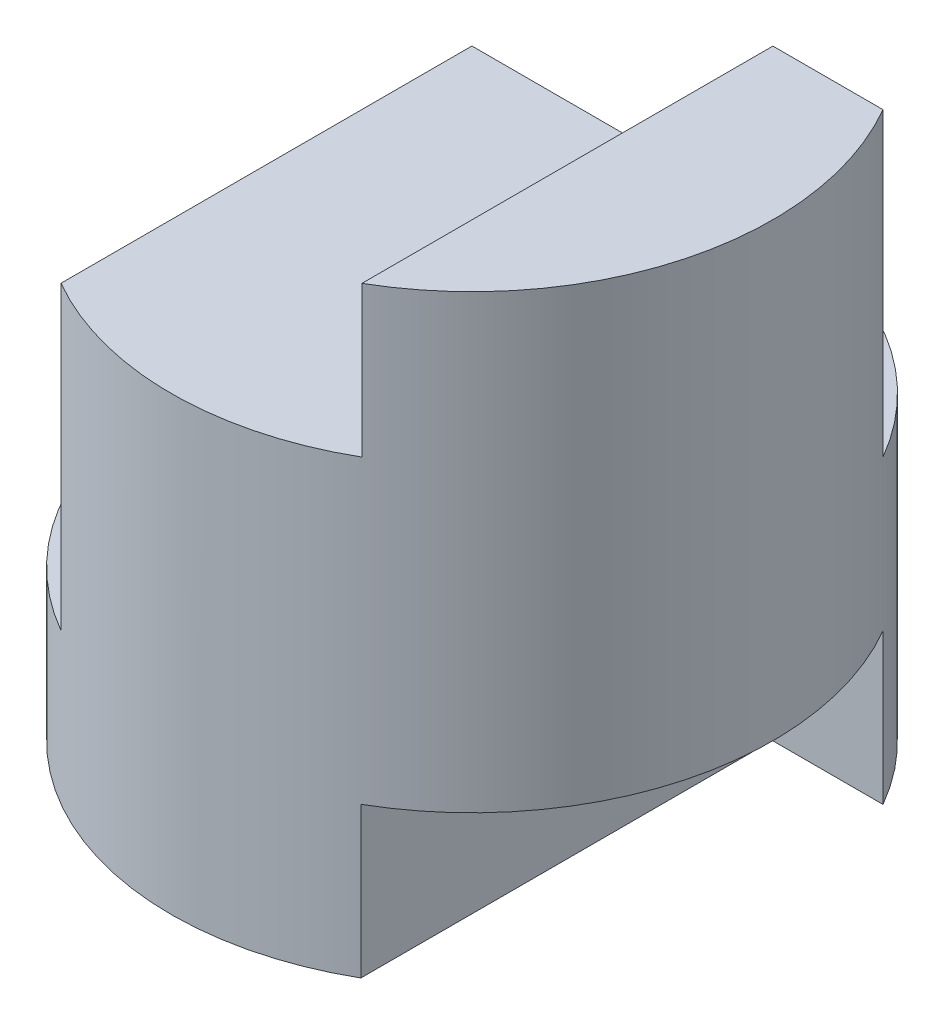
ISO-10303-21;
HEADER;
FILE_DESCRIPTION(('STEP AP214'),'2;1');
FILE_NAME('part.step','',(''),(''),'','','');
FILE_SCHEMA(('AUTOMOTIVE_DESIGN { 1 0 10303 214 1 1 1 1 }'));
ENDSEC;
DATA;
#1=APPLICATION_CONTEXT('core data for automotive mechanical design processes');
#2=APPLICATION_PROTOCOL_DEFINITION('international standard','automotive_design',2000,#1);
#3=PRODUCT_CONTEXT('',#1,'mechanical');
#4=PRODUCT('Part','Part','',(#3));
#5=PRODUCT_RELATED_PRODUCT_CATEGORY('part','',(#4));
#6=PRODUCT_DEFINITION_FORMATION('','',#4);
#7=PRODUCT_DEFINITION_CONTEXT('part definition',#1,'design');
#8=PRODUCT_DEFINITION('design','',#6,#7);
#9=PRODUCT_DEFINITION_SHAPE('','',#8);
#10=(LENGTH_UNIT() NAMED_UNIT(*) SI_UNIT(.MILLI.,.METRE.));
#11=(NAMED_UNIT(*) PLANE_ANGLE_UNIT() SI_UNIT($,.RADIAN.));
#12=(NAMED_UNIT(*) SI_UNIT($,.STERADIAN.) SOLID_ANGLE_UNIT());
#13=UNCERTAINTY_MEASURE_WITH_UNIT(LENGTH_MEASURE(1.E-05),#10,'distance_accuracy_value','');
#14=(GEOMETRIC_REPRESENTATION_CONTEXT(3) GLOBAL_UNCERTAINTY_ASSIGNED_CONTEXT((#13)) GLOBAL_UNIT_ASSIGNED_CONTEXT((#10,
#11,#12)) REPRESENTATION_CONTEXT('',''));
#15=CARTESIAN_POINT('',(0.,0.,0.));
#16=DIRECTION('',(0.,0.,1.));
#17=DIRECTION('',(1.,0.,0.));
#18=AXIS2_PLACEMENT_3D('',#15,#16,#17);
#19=CARTESIAN_POINT('',(0.,4.,0.));
#20=DIRECTION('',(0.,-1.,0.));
#21=DIRECTION('',(0.,0.,-1.));
#22=AXIS2_PLACEMENT_3D('',#19,#20,#21);
#23=CYLINDRICAL_SURFACE('',#22,2.);
#24=DIRECTION('',(0.,-1.,0.));
#25=VECTOR('',#24,1.);
#26=CARTESIAN_POINT('',(0.99550174465044,4.,1.73464009996251));
#27=LINE('',#26,#25);
#28=CARTESIAN_POINT('',(0.99550174465044,1.,1.73464009996251));
#29=VERTEX_POINT('',#28);
#30=CARTESIAN_POINT('',(0.99550174465044,0.,1.73464009996251));
#31=VERTEX_POINT('',#30);
#32=EDGE_CURVE('E141',#29,#31,#27,.T.);
#33=ORIENTED_EDGE('',*,*,#32,.F.);
#34=CARTESIAN_POINT('',(0.,1.,0.));
#35=DIRECTION('',(0.,-1.,0.));
#36=DIRECTION('',(0.,0.,-1.));
#37=AXIS2_PLACEMENT_3D('',#34,#35,#36);
#38=CIRCLE('',#37,2.);
#39=CARTESIAN_POINT('',(1.73205080756888,1.,-1.));
#40=VERTEX_POINT('',#39);
#41=EDGE_CURVE('E40',#40,#29,#38,.T.);
#42=ORIENTED_EDGE('',*,*,#41,.F.);
#43=DIRECTION('',(0.,-1.,0.));
#44=VECTOR('',#43,1.);
#45=CARTESIAN_POINT('',(1.73205080756888,4.,-1.));
#46=LINE('',#45,#44);
#47=CARTESIAN_POINT('',(1.73205080756888,0.,-1.));
#48=VERTEX_POINT('',#47);
#49=EDGE_CURVE('E139',#48,#40,#46,.F.);
#50=ORIENTED_EDGE('',*,*,#49,.F.);
#51=CARTESIAN_POINT('',(0.,0.,0.));
#52=DIRECTION('',(0.,1.,0.));
#53=DIRECTION('',(0.,0.,1.));
#54=AXIS2_PLACEMENT_3D('',#51,#52,#53);
#55=CIRCLE('',#54,2.);
#56=EDGE_CURVE('E160',#48,#31,#55,.T.);
#57=ORIENTED_EDGE('',*,*,#56,.T.);
#58=EDGE_LOOP('',(#33,#42,#50,#57));
#59=FACE_BOUND('',#58,.T.);
#60=DIRECTION('',(0.,-1.,0.));
#61=VECTOR('',#60,1.);
#62=CARTESIAN_POINT('',(-1.00088278766461,4.,1.73154082982664));
#63=LINE('',#62,#61);
#64=CARTESIAN_POINT('',(-1.00088278766461,3.,1.73154082982664));
#65=VERTEX_POINT('',#64);
#66=CARTESIAN_POINT('',(-1.00088278766461,1.,1.73154082982664));
#67=VERTEX_POINT('',#66);
#68=EDGE_CURVE('E172',#65,#67,#63,.T.);
#69=ORIENTED_EDGE('',*,*,#68,.T.);
#70=CARTESIAN_POINT('',(0.,1.,0.));
#71=DIRECTION('',(0.,1.,0.));
#72=DIRECTION('',(0.,0.,1.));
#73=AXIS2_PLACEMENT_3D('',#70,#71,#72);
#74=CIRCLE('',#73,2.);
#75=CARTESIAN_POINT('',(-1.73205080756888,1.,-1.));
#76=VERTEX_POINT('',#75);
#77=EDGE_CURVE('E11',#76,#67,#74,.T.);
#78=ORIENTED_EDGE('',*,*,#77,.F.);
#79=DIRECTION('',(0.,-1.,0.));
#80=VECTOR('',#79,1.);
#81=CARTESIAN_POINT('',(-1.73205080756888,4.,-1.));
#82=LINE('',#81,#80);
#83=CARTESIAN_POINT('',(-1.73205080756888,2.,-1.));
#84=VERTEX_POINT('',#83);
#85=EDGE_CURVE('E115',#76,#84,#82,.F.);
#86=ORIENTED_EDGE('',*,*,#85,.T.);
#87=CARTESIAN_POINT('',(0.,2.,0.));
#88=DIRECTION('',(0.,-1.,0.));
#89=DIRECTION('',(0.,0.,-1.));
#90=AXIS2_PLACEMENT_3D('',#87,#88,#89);
#91=CIRCLE('',#90,2.);
#92=CARTESIAN_POINT('',(1.73205080756888,2.,-1.));
#93=VERTEX_POINT('',#92);
#94=EDGE_CURVE('E174',#84,#93,#91,.T.);
#95=ORIENTED_EDGE('',*,*,#94,.T.);
#96=DIRECTION('',(0.,1.,0.));
#97=VECTOR('',#96,1.);
#98=CARTESIAN_POINT('',(1.73205080756888,2.,-1.));
#99=LINE('',#98,#97);
#100=CARTESIAN_POINT('',(1.73205080756888,4.,-1.));
#101=VERTEX_POINT('',#100);
#102=EDGE_CURVE('E147',#93,#101,#99,.T.);
#103=ORIENTED_EDGE('',*,*,#102,.T.);
#104=CARTESIAN_POINT('',(0.,4.,0.));
#105=DIRECTION('',(0.,1.,0.));
#106=DIRECTION('',(0.,0.,1.));
#107=AXIS2_PLACEMENT_3D('',#104,#105,#106);
#108=CIRCLE('',#107,2.);
#109=CARTESIAN_POINT('',(1.,4.,1.73205080756888));
#110=VERTEX_POINT('',#109);
#111=EDGE_CURVE('E161',#110,#101,#108,.T.);
#112=ORIENTED_EDGE('',*,*,#111,.F.);
#113=DIRECTION('',(0.,-1.,0.));
#114=VECTOR('',#113,1.);
#115=CARTESIAN_POINT('',(1.,4.,1.73205080756888));
#116=LINE('',#115,#114);
#117=CARTESIAN_POINT('',(1.,3.,1.73205080756888));
#118=VERTEX_POINT('',#117);
#119=EDGE_CURVE('E156',#110,#118,#116,.T.);
#120=ORIENTED_EDGE('',*,*,#119,.T.);
#121=CARTESIAN_POINT('',(0.,3.,0.));
#122=DIRECTION('',(0.,-1.,0.));
#123=DIRECTION('',(0.,0.,-1.));
#124=AXIS2_PLACEMENT_3D('',#121,#122,#123);
#125=CIRCLE('',#124,2.);
#126=EDGE_CURVE('E169',#118,#65,#125,.T.);
#127=ORIENTED_EDGE('',*,*,#126,.T.);
#128=EDGE_LOOP('',(#69,#78,#86,#95,#103,#112,#120,#127));
#129=FACE_BOUND('',#128,.T.);
#130=ADVANCED_FACE('F33',(#59,#129),#23,.T.);
#131=CARTESIAN_POINT('',(0.,0.,0.));
#132=DIRECTION('',(0.,1.,0.));
#133=DIRECTION('',(0.,0.,1.));
#134=AXIS2_PLACEMENT_3D('',#131,#132,#133);
#135=PLANE('',#134);
#136=DIRECTION('',(0.,0.,-1.));
#137=VECTOR('',#136,1.);
#138=CARTESIAN_POINT('',(0.99550174465044,0.,0.));
#139=LINE('',#138,#137);
#140=CARTESIAN_POINT('',(0.99550174465044,0.,-1.));
#141=VERTEX_POINT('',#140);
#142=EDGE_CURVE('E178',#31,#141,#139,.T.);
#143=ORIENTED_EDGE('',*,*,#142,.F.);
#144=ORIENTED_EDGE('',*,*,#56,.F.);
#145=DIRECTION('',(1.,0.,0.));
#146=VECTOR('',#145,1.);
#147=CARTESIAN_POINT('',(2.,0.,-1.));
#148=LINE('',#147,#146);
#149=EDGE_CURVE('E131',#141,#48,#148,.T.);
#150=ORIENTED_EDGE('',*,*,#149,.F.);
#151=EDGE_LOOP('',(#143,#144,#150));
#152=FACE_BOUND('',#151,.T.);
#153=ADVANCED_FACE('F194',(#152),#135,.F.);
#154=CARTESIAN_POINT('',(0.,4.,0.));
#155=DIRECTION('',(0.,1.,0.));
#156=DIRECTION('',(0.,0.,1.));
#157=AXIS2_PLACEMENT_3D('',#154,#155,#156);
#158=PLANE('',#157);
#159=DIRECTION('',(1.,0.,0.));
#160=VECTOR('',#159,1.);
#161=CARTESIAN_POINT('',(-1.73205080756888,4.,-1.));
#162=LINE('',#161,#160);
#163=CARTESIAN_POINT('',(0.999999999999999,4.,-1.));
#164=VERTEX_POINT('',#163);
#165=EDGE_CURVE('E143',#164,#101,#162,.T.);
#166=ORIENTED_EDGE('',*,*,#165,.F.);
#167=DIRECTION('',(0.,0.,-1.));
#168=VECTOR('',#167,1.);
#169=CARTESIAN_POINT('',(1.,4.,0.));
#170=LINE('',#169,#168);
#171=EDGE_CURVE('E164',#110,#164,#170,.T.);
#172=ORIENTED_EDGE('',*,*,#171,.F.);
#173=ORIENTED_EDGE('',*,*,#111,.T.);
#174=EDGE_LOOP('',(#166,#172,#173));
#175=FACE_BOUND('',#174,.T.);
#176=ADVANCED_FACE('F207',(#175),#158,.T.);
#177=CARTESIAN_POINT('',(-1.00088278766461,3.,-2.));
#178=DIRECTION('',(0.,-1.,0.));
#179=DIRECTION('',(0.,0.,-1.));
#180=AXIS2_PLACEMENT_3D('',#177,#178,#179);
#181=PLANE('',#180);
#182=DIRECTION('',(0.,0.,1.));
#183=VECTOR('',#182,1.);
#184=CARTESIAN_POINT('',(1.,3.,-2.));
#185=LINE('',#184,#183);
#186=CARTESIAN_POINT('',(1.,3.,-1.));
#187=VERTEX_POINT('',#186);
#188=EDGE_CURVE('E154',#187,#118,#185,.T.);
#189=ORIENTED_EDGE('',*,*,#188,.F.);
#190=DIRECTION('',(-1.,0.,0.));
#191=VECTOR('',#190,1.);
#192=CARTESIAN_POINT('',(-1.00088278766461,3.,-1.));
#193=LINE('',#192,#191);
#194=CARTESIAN_POINT('',(-1.00088278766461,3.,-1.));
#195=VERTEX_POINT('',#194);
#196=EDGE_CURVE('E55',#187,#195,#193,.T.);
#197=ORIENTED_EDGE('',*,*,#196,.T.);
#198=DIRECTION('',(0.,0.,1.));
#199=VECTOR('',#198,1.);
#200=CARTESIAN_POINT('',(-1.00088278766461,3.,-2.));
#201=LINE('',#200,#199);
#202=EDGE_CURVE('E153',#195,#65,#201,.T.);
#203=ORIENTED_EDGE('',*,*,#202,.T.);
#204=ORIENTED_EDGE('',*,*,#126,.F.);
#205=EDGE_LOOP('',(#189,#197,#203,#204));
#206=FACE_BOUND('',#205,.T.);
#207=ADVANCED_FACE('F211',(#206),#181,.F.);
#208=CARTESIAN_POINT('',(-1.00088278766461,2.,-2.));
#209=DIRECTION('',(1.,0.,0.));
#210=DIRECTION('',(0.,0.,-1.));
#211=AXIS2_PLACEMENT_3D('',#208,#209,#210);
#212=PLANE('',#211);
#213=ORIENTED_EDGE('',*,*,#202,.F.);
#214=DIRECTION('',(0.,-1.,0.));
#215=VECTOR('',#214,1.);
#216=CARTESIAN_POINT('',(-1.00088278766461,2.,-1.));
#217=LINE('',#216,#215);
#218=CARTESIAN_POINT('',(-1.00088278766461,2.,-1.));
#219=VERTEX_POINT('',#218);
#220=EDGE_CURVE('E127',#195,#219,#217,.T.);
#221=ORIENTED_EDGE('',*,*,#220,.T.);
#222=DIRECTION('',(0.,1.,0.));
#223=VECTOR('',#222,1.);
#224=CARTESIAN_POINT('',(-1.00088278766461,2.,-1.));
#225=LINE('',#224,#223);
#226=CARTESIAN_POINT('',(-1.00088278766461,1.,-1.));
#227=VERTEX_POINT('',#226);
#228=EDGE_CURVE('E119',#227,#219,#225,.T.);
#229=ORIENTED_EDGE('',*,*,#228,.F.);
#230=DIRECTION('',(0.,0.,-1.));
#231=VECTOR('',#230,1.);
#232=CARTESIAN_POINT('',(-1.00088278766461,1.,2.));
#233=LINE('',#232,#231);
#234=EDGE_CURVE('E106',#67,#227,#233,.T.);
#235=ORIENTED_EDGE('',*,*,#234,.F.);
#236=ORIENTED_EDGE('',*,*,#68,.F.);
#237=EDGE_LOOP('',(#213,#221,#229,#235,#236));
#238=FACE_BOUND('',#237,.T.);
#239=ADVANCED_FACE('F126',(#238),#212,.F.);
#240=CARTESIAN_POINT('',(-2.,2.,-2.));
#241=DIRECTION('',(0.,-1.,0.));
#242=DIRECTION('',(0.,0.,-1.));
#243=AXIS2_PLACEMENT_3D('',#240,#241,#242);
#244=PLANE('',#243);
#245=ORIENTED_EDGE('',*,*,#94,.F.);
#246=DIRECTION('',(-1.,0.,0.));
#247=VECTOR('',#246,1.);
#248=CARTESIAN_POINT('',(-1.00088278766461,2.,-1.));
#249=LINE('',#248,#247);
#250=EDGE_CURVE('E122',#219,#84,#249,.T.);
#251=ORIENTED_EDGE('',*,*,#250,.F.);
#252=DIRECTION('',(1.,0.,0.));
#253=VECTOR('',#252,1.);
#254=CARTESIAN_POINT('',(-1.73205080756888,2.,-1.));
#255=LINE('',#254,#253);
#256=EDGE_CURVE('E144',#219,#93,#255,.T.);
#257=ORIENTED_EDGE('',*,*,#256,.T.);
#258=EDGE_LOOP('',(#245,#251,#257));
#259=FACE_BOUND('',#258,.T.);
#260=ADVANCED_FACE('F215',(#259),#244,.F.);
#261=CARTESIAN_POINT('',(1.,3.,-2.));
#262=DIRECTION('',(1.,0.,0.));
#263=DIRECTION('',(0.,0.,-1.));
#264=AXIS2_PLACEMENT_3D('',#261,#262,#263);
#265=PLANE('',#264);
#266=ORIENTED_EDGE('',*,*,#171,.T.);
#267=DIRECTION('',(0.,-1.,0.));
#268=VECTOR('',#267,1.);
#269=CARTESIAN_POINT('',(1.,3.,-1.));
#270=LINE('',#269,#268);
#271=EDGE_CURVE('E176',#164,#187,#270,.T.);
#272=ORIENTED_EDGE('',*,*,#271,.T.);
#273=ORIENTED_EDGE('',*,*,#188,.T.);
#274=ORIENTED_EDGE('',*,*,#119,.F.);
#275=EDGE_LOOP('',(#266,#272,#273,#274));
#276=FACE_BOUND('',#275,.T.);
#277=ADVANCED_FACE('F218',(#276),#265,.F.);
#278=CARTESIAN_POINT('',(-1.73205080756888,2.,-1.));
#279=DIRECTION('',(0.,0.,1.));
#280=DIRECTION('',(1.,0.,0.));
#281=AXIS2_PLACEMENT_3D('',#278,#279,#280);
#282=PLANE('',#281);
#283=ORIENTED_EDGE('',*,*,#196,.F.);
#284=ORIENTED_EDGE('',*,*,#271,.F.);
#285=ORIENTED_EDGE('',*,*,#165,.T.);
#286=ORIENTED_EDGE('',*,*,#102,.F.);
#287=ORIENTED_EDGE('',*,*,#256,.F.);
#288=ORIENTED_EDGE('',*,*,#220,.F.);
#289=EDGE_LOOP('',(#283,#284,#285,#286,#287,#288));
#290=FACE_BOUND('',#289,.T.);
#291=ADVANCED_FACE('F227',(#290),#282,.F.);
#292=CARTESIAN_POINT('',(-1.00088278766461,1.,2.));
#293=DIRECTION('',(0.,1.,0.));
#294=DIRECTION('',(0.,0.,1.));
#295=AXIS2_PLACEMENT_3D('',#292,#293,#294);
#296=PLANE('',#295);
#297=ORIENTED_EDGE('',*,*,#77,.T.);
#298=ORIENTED_EDGE('',*,*,#234,.T.);
#299=DIRECTION('',(1.,0.,0.));
#300=VECTOR('',#299,1.);
#301=CARTESIAN_POINT('',(-1.00088278766461,1.,-1.));
#302=LINE('',#301,#300);
#303=EDGE_CURVE('E109',#76,#227,#302,.T.);
#304=ORIENTED_EDGE('',*,*,#303,.F.);
#305=EDGE_LOOP('',(#297,#298,#304));
#306=FACE_BOUND('',#305,.T.);
#307=ADVANCED_FACE('F108',(#306),#296,.T.);
#308=CARTESIAN_POINT('',(0.,0.,-1.));
#309=DIRECTION('',(0.,0.,-1.));
#310=DIRECTION('',(-1.,0.,0.));
#311=AXIS2_PLACEMENT_3D('',#308,#309,#310);
#312=PLANE('',#311);
#313=ORIENTED_EDGE('',*,*,#303,.T.);
#314=ORIENTED_EDGE('',*,*,#228,.T.);
#315=ORIENTED_EDGE('',*,*,#250,.T.);
#316=ORIENTED_EDGE('',*,*,#85,.F.);
#317=EDGE_LOOP('',(#313,#314,#315,#316));
#318=FACE_BOUND('',#317,.T.);
#319=ADVANCED_FACE('F118',(#318),#312,.F.);
#320=CARTESIAN_POINT('',(2.,1.,2.));
#321=DIRECTION('',(0.,-1.,0.));
#322=DIRECTION('',(0.,0.,-1.));
#323=AXIS2_PLACEMENT_3D('',#320,#321,#322);
#324=PLANE('',#323);
#325=ORIENTED_EDGE('',*,*,#41,.T.);
#326=DIRECTION('',(0.,0.,-1.));
#327=VECTOR('',#326,1.);
#328=CARTESIAN_POINT('',(0.99550174465044,1.,2.));
#329=LINE('',#328,#327);
#330=CARTESIAN_POINT('',(0.99550174465044,1.,-1.));
#331=VERTEX_POINT('',#330);
#332=EDGE_CURVE('E128',#29,#331,#329,.T.);
#333=ORIENTED_EDGE('',*,*,#332,.T.);
#334=DIRECTION('',(-1.,0.,0.));
#335=VECTOR('',#334,1.);
#336=CARTESIAN_POINT('',(2.,1.,-1.));
#337=LINE('',#336,#335);
#338=EDGE_CURVE('E134',#40,#331,#337,.T.);
#339=ORIENTED_EDGE('',*,*,#338,.F.);
#340=EDGE_LOOP('',(#325,#333,#339));
#341=FACE_BOUND('',#340,.T.);
#342=ADVANCED_FACE('F183',(#341),#324,.T.);
#343=CARTESIAN_POINT('',(0.99550174465044,0.,2.));
#344=DIRECTION('',(1.,0.,0.));
#345=DIRECTION('',(0.,0.,-1.));
#346=AXIS2_PLACEMENT_3D('',#343,#344,#345);
#347=PLANE('',#346);
#348=ORIENTED_EDGE('',*,*,#32,.T.);
#349=ORIENTED_EDGE('',*,*,#142,.T.);
#350=DIRECTION('',(0.,-1.,0.));
#351=VECTOR('',#350,1.);
#352=CARTESIAN_POINT('',(0.99550174465044,0.,-1.));
#353=LINE('',#352,#351);
#354=EDGE_CURVE('E47',#331,#141,#353,.T.);
#355=ORIENTED_EDGE('',*,*,#354,.F.);
#356=ORIENTED_EDGE('',*,*,#332,.F.);
#357=EDGE_LOOP('',(#348,#349,#355,#356));
#358=FACE_BOUND('',#357,.T.);
#359=ADVANCED_FACE('F188',(#358),#347,.T.);
#360=CARTESIAN_POINT('',(0.,0.,-1.));
#361=DIRECTION('',(0.,0.,1.));
#362=DIRECTION('',(1.,0.,0.));
#363=AXIS2_PLACEMENT_3D('',#360,#361,#362);
#364=PLANE('',#363);
#365=ORIENTED_EDGE('',*,*,#49,.T.);
#366=ORIENTED_EDGE('',*,*,#338,.T.);
#367=ORIENTED_EDGE('',*,*,#354,.T.);
#368=ORIENTED_EDGE('',*,*,#149,.T.);
#369=EDGE_LOOP('',(#365,#366,#367,#368));
#370=FACE_BOUND('',#369,.T.);
#371=ADVANCED_FACE('F195',(#370),#364,.T.);
#372=CLOSED_SHELL('',(#130,#153,#176,#207,#239,#260,#277,#291,#307,#319,#342,#359,#371));
#373=MANIFOLD_SOLID_BREP('B2',#372);
#374=ADVANCED_BREP_SHAPE_REPRESENTATION('',(#18,#373),#14);
#375=SHAPE_DEFINITION_REPRESENTATION(#9,#374);
ENDSEC;
END-ISO-10303-21;
